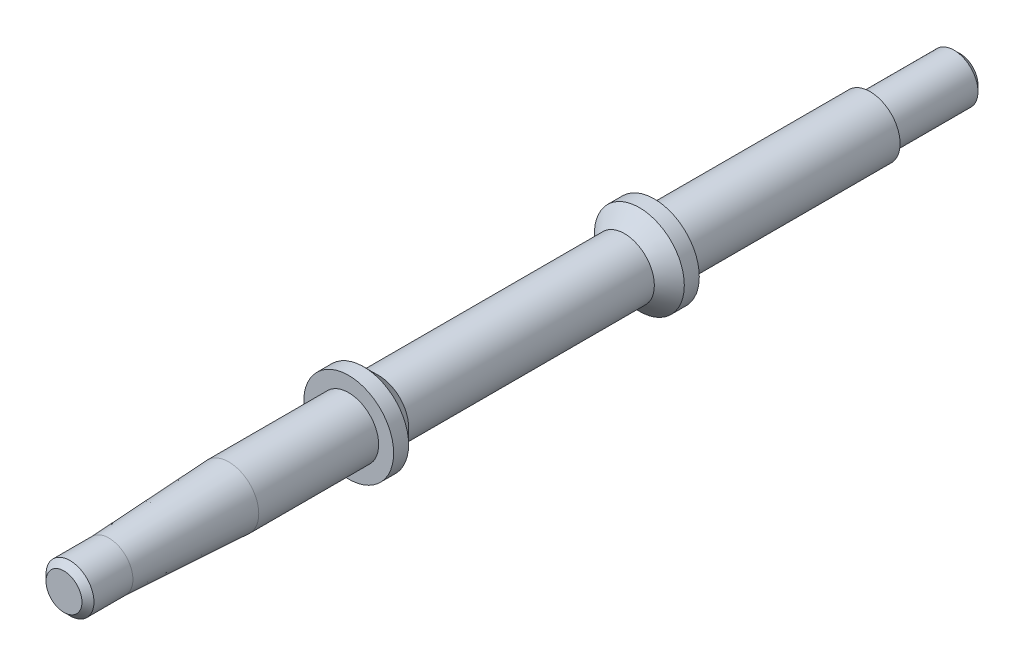
ISO-10303-21;
HEADER;
FILE_DESCRIPTION(('STEP AP214'),'2;1');
FILE_NAME('part.step','',(''),(''),'','','');
FILE_SCHEMA(('AUTOMOTIVE_DESIGN { 1 0 10303 214 1 1 1 1 }'));
ENDSEC;
DATA;
#1=APPLICATION_CONTEXT('core data for automotive mechanical design processes');
#2=APPLICATION_PROTOCOL_DEFINITION('international standard','automotive_design',2000,#1);
#3=PRODUCT_CONTEXT('',#1,'mechanical');
#4=PRODUCT('Part','Part','',(#3));
#5=PRODUCT_RELATED_PRODUCT_CATEGORY('part','',(#4));
#6=PRODUCT_DEFINITION_FORMATION('','',#4);
#7=PRODUCT_DEFINITION_CONTEXT('part definition',#1,'design');
#8=PRODUCT_DEFINITION('design','',#6,#7);
#9=PRODUCT_DEFINITION_SHAPE('','',#8);
#10=(LENGTH_UNIT() NAMED_UNIT(*) SI_UNIT(.MILLI.,.METRE.));
#11=(NAMED_UNIT(*) PLANE_ANGLE_UNIT() SI_UNIT($,.RADIAN.));
#12=(NAMED_UNIT(*) SI_UNIT($,.STERADIAN.) SOLID_ANGLE_UNIT());
#13=UNCERTAINTY_MEASURE_WITH_UNIT(LENGTH_MEASURE(1.E-05),#10,'distance_accuracy_value','');
#14=(GEOMETRIC_REPRESENTATION_CONTEXT(3) GLOBAL_UNCERTAINTY_ASSIGNED_CONTEXT((#13)) GLOBAL_UNIT_ASSIGNED_CONTEXT((#10,
#11,#12)) REPRESENTATION_CONTEXT('',''));
#15=CARTESIAN_POINT('',(0.,0.,0.));
#16=DIRECTION('',(0.,0.,1.));
#17=DIRECTION('',(1.,0.,0.));
#18=AXIS2_PLACEMENT_3D('',#15,#16,#17);
#19=CARTESIAN_POINT('',(0.,0.,-87.));
#20=DIRECTION('',(0.,0.,-1.));
#21=DIRECTION('',(-1.,0.,0.));
#22=AXIS2_PLACEMENT_3D('',#19,#20,#21);
#23=PLANE('',#22);
#24=CARTESIAN_POINT('',(0.,0.,-87.));
#25=DIRECTION('',(0.,0.,-1.));
#26=DIRECTION('',(-1.,0.,0.));
#27=AXIS2_PLACEMENT_3D('',#24,#25,#26);
#28=CIRCLE('',#27,5.);
#29=CARTESIAN_POINT('',(-5.,0.,-87.));
#30=VERTEX_POINT('',#29);
#31=EDGE_CURVE('E164',#30,#30,#28,.T.);
#32=ORIENTED_EDGE('',*,*,#31,.T.);
#33=EDGE_LOOP('',(#32));
#34=FACE_BOUND('',#33,.T.);
#35=CARTESIAN_POINT('',(0.,0.,-87.));
#36=DIRECTION('',(0.,0.,-1.));
#37=DIRECTION('',(-1.,0.,0.));
#38=AXIS2_PLACEMENT_3D('',#35,#36,#37);
#39=CIRCLE('',#38,4.);
#40=CARTESIAN_POINT('',(-4.,0.,-87.));
#41=VERTEX_POINT('',#40);
#42=EDGE_CURVE('E151',#41,#41,#39,.T.);
#43=ORIENTED_EDGE('',*,*,#42,.F.);
#44=EDGE_LOOP('',(#43));
#45=FACE_BOUND('',#44,.T.);
#46=ADVANCED_FACE('F41',(#34,#45),#23,.T.);
#47=CARTESIAN_POINT('',(0.,0.,-51.));
#48=DIRECTION('',(0.,0.,1.));
#49=DIRECTION('',(1.,0.,0.));
#50=AXIS2_PLACEMENT_3D('',#47,#48,#49);
#51=CYLINDRICAL_SURFACE('',#50,7.5);
#52=CARTESIAN_POINT('',(0.,0.,-51.));
#53=DIRECTION('',(0.,0.,1.));
#54=DIRECTION('',(1.,0.,0.));
#55=AXIS2_PLACEMENT_3D('',#52,#53,#54);
#56=CIRCLE('',#55,7.5);
#57=CARTESIAN_POINT('',(7.5,0.,-51.));
#58=VERTEX_POINT('',#57);
#59=EDGE_CURVE('E175',#58,#58,#56,.T.);
#60=ORIENTED_EDGE('',*,*,#59,.T.);
#61=EDGE_LOOP('',(#60));
#62=FACE_BOUND('',#61,.T.);
#63=CARTESIAN_POINT('',(0.,0.,-48.5));
#64=DIRECTION('',(0.,0.,1.));
#65=DIRECTION('',(1.,0.,0.));
#66=AXIS2_PLACEMENT_3D('',#63,#64,#65);
#67=CIRCLE('',#66,7.5);
#68=CARTESIAN_POINT('',(7.5,0.,-48.5));
#69=VERTEX_POINT('',#68);
#70=EDGE_CURVE('E168',#69,#69,#67,.F.);
#71=ORIENTED_EDGE('',*,*,#70,.T.);
#72=EDGE_LOOP('',(#71));
#73=FACE_BOUND('',#72,.T.);
#74=ADVANCED_FACE('F103',(#62,#73),#51,.T.);
#75=CARTESIAN_POINT('',(0.,0.,-51.));
#76=DIRECTION('',(0.,0.,1.));
#77=DIRECTION('',(1.,0.,0.));
#78=AXIS2_PLACEMENT_3D('',#75,#76,#77);
#79=PLANE('',#78);
#80=ORIENTED_EDGE('',*,*,#59,.F.);
#81=EDGE_LOOP('',(#80));
#82=FACE_BOUND('',#81,.T.);
#83=CARTESIAN_POINT('',(0.,0.,-51.));
#84=DIRECTION('',(0.,0.,1.));
#85=DIRECTION('',(1.,0.,0.));
#86=AXIS2_PLACEMENT_3D('',#83,#84,#85);
#87=CIRCLE('',#86,5.);
#88=CARTESIAN_POINT('',(5.,0.,-51.));
#89=VERTEX_POINT('',#88);
#90=EDGE_CURVE('E67',#89,#89,#87,.F.);
#91=ORIENTED_EDGE('',*,*,#90,.F.);
#92=EDGE_LOOP('',(#91));
#93=FACE_BOUND('',#92,.T.);
#94=ADVANCED_FACE('F107',(#82,#93),#79,.F.);
#95=CARTESIAN_POINT('',(0.,0.,-87.));
#96=DIRECTION('',(0.,0.,1.));
#97=DIRECTION('',(1.,0.,0.));
#98=AXIS2_PLACEMENT_3D('',#95,#96,#97);
#99=CYLINDRICAL_SURFACE('',#98,5.);
#100=ORIENTED_EDGE('',*,*,#31,.F.);
#101=EDGE_LOOP('',(#100));
#102=FACE_BOUND('',#101,.T.);
#103=ORIENTED_EDGE('',*,*,#90,.T.);
#104=EDGE_LOOP('',(#103));
#105=FACE_BOUND('',#104,.T.);
#106=ADVANCED_FACE('F99',(#102,#105),#99,.T.);
#107=CARTESIAN_POINT('',(0.,0.,-48.5));
#108=DIRECTION('',(0.,0.,1.));
#109=DIRECTION('',(1.,0.,0.));
#110=AXIS2_PLACEMENT_3D('',#107,#108,#109);
#111=CYLINDRICAL_SURFACE('',#110,5.);
#112=CARTESIAN_POINT('',(0.,0.,-4.99999999999998));
#113=DIRECTION('',(0.,0.,1.));
#114=DIRECTION('',(1.,0.,0.));
#115=AXIS2_PLACEMENT_3D('',#112,#113,#114);
#116=CIRCLE('',#115,5.);
#117=CARTESIAN_POINT('',(5.,0.,-4.99999999999998));
#118=VERTEX_POINT('',#117);
#119=EDGE_CURVE('E61',#118,#118,#116,.F.);
#120=ORIENTED_EDGE('',*,*,#119,.T.);
#121=EDGE_LOOP('',(#120));
#122=FACE_BOUND('',#121,.T.);
#123=CARTESIAN_POINT('',(0.,0.,-46.));
#124=DIRECTION('',(0.,0.,1.));
#125=DIRECTION('',(1.,0.,0.));
#126=AXIS2_PLACEMENT_3D('',#123,#124,#125);
#127=CIRCLE('',#126,5.);
#128=CARTESIAN_POINT('',(5.,0.,-46.));
#129=VERTEX_POINT('',#128);
#130=EDGE_CURVE('E64',#129,#129,#127,.T.);
#131=ORIENTED_EDGE('',*,*,#130,.T.);
#132=EDGE_LOOP('',(#131));
#133=FACE_BOUND('',#132,.T.);
#134=ADVANCED_FACE('F95',(#122,#133),#111,.T.);
#135=CARTESIAN_POINT('',(0.,0.,20.));
#136=DIRECTION('',(0.,0.,-1.));
#137=DIRECTION('',(-1.,0.,0.));
#138=AXIS2_PLACEMENT_3D('',#135,#136,#137);
#139=CYLINDRICAL_SURFACE('',#138,5.);
#140=CARTESIAN_POINT('',(0.,0.,20.));
#141=DIRECTION('',(0.,0.,1.));
#142=DIRECTION('',(1.,0.,0.));
#143=AXIS2_PLACEMENT_3D('',#140,#141,#142);
#144=CIRCLE('',#143,5.);
#145=CARTESIAN_POINT('',(5.,0.,20.));
#146=VERTEX_POINT('',#145);
#147=EDGE_CURVE('E169',#146,#146,#144,.T.);
#148=ORIENTED_EDGE('',*,*,#147,.F.);
#149=EDGE_LOOP('',(#148));
#150=FACE_BOUND('',#149,.T.);
#151=CARTESIAN_POINT('',(0.,0.,0.));
#152=DIRECTION('',(0.,0.,1.));
#153=DIRECTION('',(1.,0.,0.));
#154=AXIS2_PLACEMENT_3D('',#151,#152,#153);
#155=CIRCLE('',#154,5.);
#156=CARTESIAN_POINT('',(5.,0.,0.));
#157=VERTEX_POINT('',#156);
#158=EDGE_CURVE('E167',#157,#157,#155,.T.);
#159=ORIENTED_EDGE('',*,*,#158,.T.);
#160=EDGE_LOOP('',(#159));
#161=FACE_BOUND('',#160,.T.);
#162=ADVANCED_FACE('F98',(#150,#161),#139,.T.);
#163=CARTESIAN_POINT('',(0.,0.,0.));
#164=DIRECTION('',(0.,0.,1.));
#165=DIRECTION('',(1.,0.,0.));
#166=AXIS2_PLACEMENT_3D('',#163,#164,#165);
#167=PLANE('',#166);
#168=CARTESIAN_POINT('',(0.,0.,0.));
#169=DIRECTION('',(0.,0.,1.));
#170=DIRECTION('',(1.,0.,0.));
#171=AXIS2_PLACEMENT_3D('',#168,#169,#170);
#172=CIRCLE('',#171,7.5);
#173=CARTESIAN_POINT('',(7.5,0.,0.));
#174=VERTEX_POINT('',#173);
#175=EDGE_CURVE('E172',#174,#174,#172,.T.);
#176=ORIENTED_EDGE('',*,*,#175,.T.);
#177=EDGE_LOOP('',(#176));
#178=FACE_BOUND('',#177,.T.);
#179=ORIENTED_EDGE('',*,*,#158,.F.);
#180=EDGE_LOOP('',(#179));
#181=FACE_BOUND('',#180,.T.);
#182=ADVANCED_FACE('F111',(#178,#181),#167,.T.);
#183=CARTESIAN_POINT('',(0.,0.,-2.5));
#184=DIRECTION('',(0.,0.,1.));
#185=DIRECTION('',(1.,0.,0.));
#186=AXIS2_PLACEMENT_3D('',#183,#184,#185);
#187=CIRCLE('',#186,7.5);
#188=CARTESIAN_POINT('',(7.5,0.,-2.5));
#189=VERTEX_POINT('',#188);
#190=EDGE_CURVE('E163',#189,#189,#187,.F.);
#191=ORIENTED_EDGE('',*,*,#190,.F.);
#192=EDGE_LOOP('',(#191));
#193=FACE_BOUND('',#192,.T.);
#194=ORIENTED_EDGE('',*,*,#175,.F.);
#195=EDGE_LOOP('',(#194));
#196=FACE_BOUND('',#195,.T.);
#197=ADVANCED_FACE('F94',(#193,#196),#51,.T.);
#198=CARTESIAN_POINT('',(0.,0.,-102.));
#199=DIRECTION('',(0.,0.,1.));
#200=DIRECTION('',(1.,0.,0.));
#201=AXIS2_PLACEMENT_3D('',#198,#199,#200);
#202=CYLINDRICAL_SURFACE('',#201,4.);
#203=CARTESIAN_POINT('',(0.,0.,-101.));
#204=DIRECTION('',(0.,0.,-1.));
#205=DIRECTION('',(-1.,0.,0.));
#206=AXIS2_PLACEMENT_3D('',#203,#204,#205);
#207=CIRCLE('',#206,4.);
#208=CARTESIAN_POINT('',(-4.,0.,-101.));
#209=VERTEX_POINT('',#208);
#210=EDGE_CURVE('E11',#209,#209,#207,.F.);
#211=ORIENTED_EDGE('',*,*,#210,.T.);
#212=EDGE_LOOP('',(#211));
#213=FACE_BOUND('',#212,.T.);
#214=ORIENTED_EDGE('',*,*,#42,.T.);
#215=EDGE_LOOP('',(#214));
#216=FACE_BOUND('',#215,.T.);
#217=ADVANCED_FACE('F91',(#213,#216),#202,.T.);
#218=CARTESIAN_POINT('',(0.,0.,-102.));
#219=DIRECTION('',(0.,0.,-1.));
#220=DIRECTION('',(-1.,0.,0.));
#221=AXIS2_PLACEMENT_3D('',#218,#219,#220);
#222=PLANE('',#221);
#223=CARTESIAN_POINT('',(0.,0.,-102.));
#224=DIRECTION('',(0.,0.,-1.));
#225=DIRECTION('',(-1.,0.,0.));
#226=AXIS2_PLACEMENT_3D('',#223,#224,#225);
#227=CIRCLE('',#226,3.);
#228=CARTESIAN_POINT('',(-3.,0.,-102.));
#229=VERTEX_POINT('',#228);
#230=EDGE_CURVE('E48',#229,#229,#227,.T.);
#231=ORIENTED_EDGE('',*,*,#230,.T.);
#232=EDGE_LOOP('',(#231));
#233=FACE_BOUND('',#232,.T.);
#234=ADVANCED_FACE('F85',(#233),#222,.T.);
#235=CARTESIAN_POINT('',(0.,0.,20.));
#236=DIRECTION('',(0.,0.,-1.));
#237=DIRECTION('',(1.,0.,0.));
#238=AXIS2_PLACEMENT_3D('',#235,#236,#237);
#239=CONICAL_SURFACE('',#238,5.,0.0499600498383378);
#240=CARTESIAN_POINT('',(0.,0.,40.));
#241=DIRECTION('',(0.,0.,1.));
#242=DIRECTION('',(1.,0.,0.));
#243=AXIS2_PLACEMENT_3D('',#240,#241,#242);
#244=CIRCLE('',#243,4.);
#245=CARTESIAN_POINT('',(4.,0.,40.));
#246=VERTEX_POINT('',#245);
#247=EDGE_CURVE('E149',#246,#246,#244,.T.);
#248=ORIENTED_EDGE('',*,*,#247,.F.);
#249=EDGE_LOOP('',(#248));
#250=FACE_BOUND('',#249,.T.);
#251=ORIENTED_EDGE('',*,*,#147,.T.);
#252=EDGE_LOOP('',(#251));
#253=FACE_BOUND('',#252,.T.);
#254=ADVANCED_FACE('F74',(#250,#253),#239,.T.);
#255=CARTESIAN_POINT('',(0.,0.,47.5));
#256=DIRECTION('',(0.,0.,-1.));
#257=DIRECTION('',(-1.,0.,0.));
#258=AXIS2_PLACEMENT_3D('',#255,#256,#257);
#259=CYLINDRICAL_SURFACE('',#258,4.);
#260=CARTESIAN_POINT('',(0.,0.,46.5));
#261=DIRECTION('',(0.,0.,1.));
#262=DIRECTION('',(1.,0.,0.));
#263=AXIS2_PLACEMENT_3D('',#260,#261,#262);
#264=CIRCLE('',#263,4.);
#265=CARTESIAN_POINT('',(4.,0.,46.5));
#266=VERTEX_POINT('',#265);
#267=EDGE_CURVE('E52',#266,#266,#264,.F.);
#268=ORIENTED_EDGE('',*,*,#267,.T.);
#269=EDGE_LOOP('',(#268));
#270=FACE_BOUND('',#269,.T.);
#271=ORIENTED_EDGE('',*,*,#247,.T.);
#272=EDGE_LOOP('',(#271));
#273=FACE_BOUND('',#272,.T.);
#274=ADVANCED_FACE('F84',(#270,#273),#259,.T.);
#275=CARTESIAN_POINT('',(0.,0.,47.5));
#276=DIRECTION('',(0.,0.,1.));
#277=DIRECTION('',(1.,0.,0.));
#278=AXIS2_PLACEMENT_3D('',#275,#276,#277);
#279=PLANE('',#278);
#280=CARTESIAN_POINT('',(0.,0.,47.5));
#281=DIRECTION('',(0.,0.,1.));
#282=DIRECTION('',(1.,0.,0.));
#283=AXIS2_PLACEMENT_3D('',#280,#281,#282);
#284=CIRCLE('',#283,3.);
#285=CARTESIAN_POINT('',(3.,0.,47.5));
#286=VERTEX_POINT('',#285);
#287=EDGE_CURVE('E56',#286,#286,#284,.T.);
#288=ORIENTED_EDGE('',*,*,#287,.T.);
#289=EDGE_LOOP('',(#288));
#290=FACE_BOUND('',#289,.T.);
#291=ADVANCED_FACE('F126',(#290),#279,.T.);
#292=CARTESIAN_POINT('',(0.,0.,-2.5));
#293=DIRECTION('',(0.,0.,1.));
#294=DIRECTION('',(1.,0.,0.));
#295=AXIS2_PLACEMENT_3D('',#292,#293,#294);
#296=CONICAL_SURFACE('',#295,7.49999999999999,0.785398163397452);
#297=ORIENTED_EDGE('',*,*,#119,.F.);
#298=EDGE_LOOP('',(#297));
#299=FACE_BOUND('',#298,.T.);
#300=ORIENTED_EDGE('',*,*,#190,.T.);
#301=EDGE_LOOP('',(#300));
#302=FACE_BOUND('',#301,.T.);
#303=ADVANCED_FACE('F122',(#299,#302),#296,.T.);
#304=CARTESIAN_POINT('',(0.,0.,-46.));
#305=DIRECTION('',(0.,0.,-1.));
#306=DIRECTION('',(-1.,0.,0.));
#307=AXIS2_PLACEMENT_3D('',#304,#305,#306);
#308=CONICAL_SURFACE('',#307,5.,0.785398163397444);
#309=ORIENTED_EDGE('',*,*,#70,.F.);
#310=EDGE_LOOP('',(#309));
#311=FACE_BOUND('',#310,.T.);
#312=ORIENTED_EDGE('',*,*,#130,.F.);
#313=EDGE_LOOP('',(#312));
#314=FACE_BOUND('',#313,.T.);
#315=ADVANCED_FACE('F125',(#311,#314),#308,.T.);
#316=CARTESIAN_POINT('',(0.,0.,47.5));
#317=DIRECTION('',(0.,0.,-1.));
#318=DIRECTION('',(-1.,0.,0.));
#319=AXIS2_PLACEMENT_3D('',#316,#317,#318);
#320=CONICAL_SURFACE('',#319,3.,0.785398163397447);
#321=ORIENTED_EDGE('',*,*,#267,.F.);
#322=EDGE_LOOP('',(#321));
#323=FACE_BOUND('',#322,.T.);
#324=ORIENTED_EDGE('',*,*,#287,.F.);
#325=EDGE_LOOP('',(#324));
#326=FACE_BOUND('',#325,.T.);
#327=ADVANCED_FACE('F129',(#323,#326),#320,.T.);
#328=CARTESIAN_POINT('',(0.,0.,-102.));
#329=DIRECTION('',(0.,0.,1.));
#330=DIRECTION('',(1.,0.,0.));
#331=AXIS2_PLACEMENT_3D('',#328,#329,#330);
#332=CONICAL_SURFACE('',#331,3.,0.785398163397447);
#333=ORIENTED_EDGE('',*,*,#210,.F.);
#334=EDGE_LOOP('',(#333));
#335=FACE_BOUND('',#334,.T.);
#336=ORIENTED_EDGE('',*,*,#230,.F.);
#337=EDGE_LOOP('',(#336));
#338=FACE_BOUND('',#337,.T.);
#339=ADVANCED_FACE('F43',(#335,#338),#332,.T.);
#340=CLOSED_SHELL('',(#46,#74,#94,#106,#134,#162,#182,#197,#217,#234,#254,#274,#291,#303,#315,
#327,#339));
#341=MANIFOLD_SOLID_BREP('B2',#340);
#342=ADVANCED_BREP_SHAPE_REPRESENTATION('',(#18,#341),#14);
#343=SHAPE_DEFINITION_REPRESENTATION(#9,#342);
ENDSEC;
END-ISO-10303-21;
